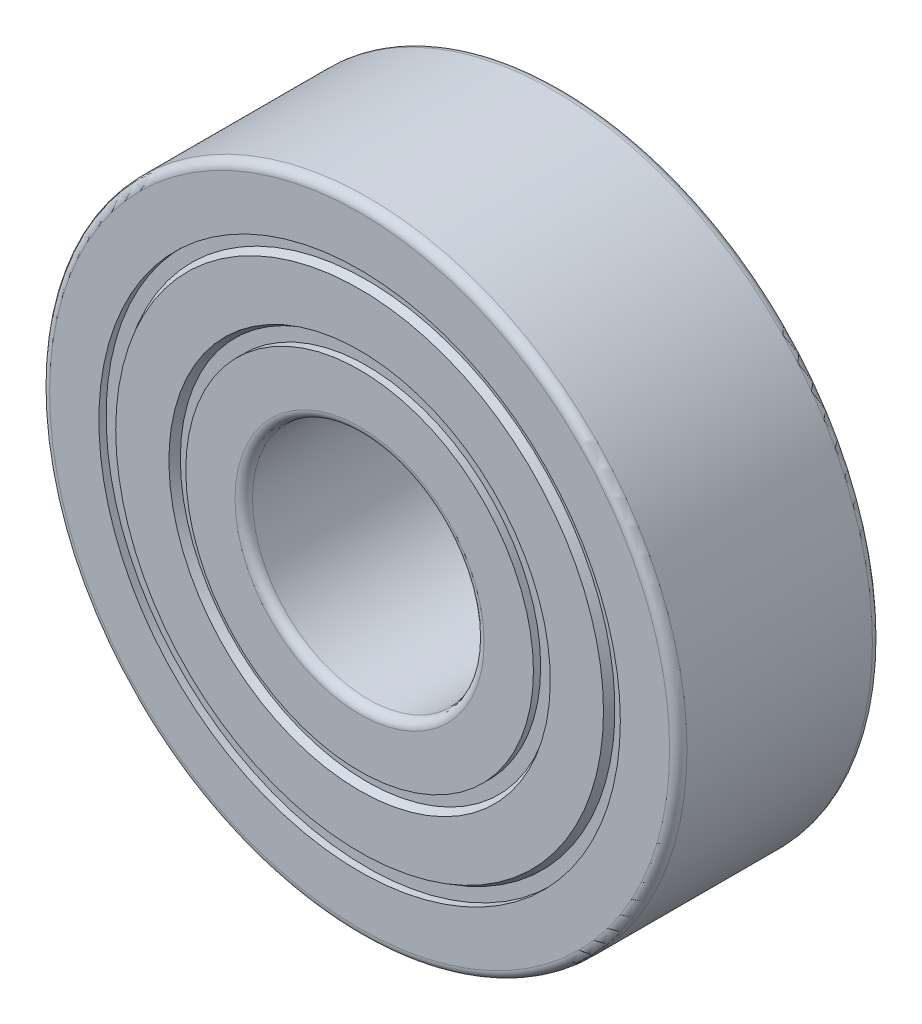
ISO-10303-21;
HEADER;
FILE_DESCRIPTION(('STEP AP214'),'2;1');
FILE_NAME('part.step','',(''),(''),'','','');
FILE_SCHEMA(('AUTOMOTIVE_DESIGN { 1 0 10303 214 1 1 1 1 }'));
ENDSEC;
DATA;
#1=APPLICATION_CONTEXT('core data for automotive mechanical design processes');
#2=APPLICATION_PROTOCOL_DEFINITION('international standard','automotive_design',2000,#1);
#3=PRODUCT_CONTEXT('',#1,'mechanical');
#4=PRODUCT('Part','Part','',(#3));
#5=PRODUCT_RELATED_PRODUCT_CATEGORY('part','',(#4));
#6=PRODUCT_DEFINITION_FORMATION('','',#4);
#7=PRODUCT_DEFINITION_CONTEXT('part definition',#1,'design');
#8=PRODUCT_DEFINITION('design','',#6,#7);
#9=PRODUCT_DEFINITION_SHAPE('','',#8);
#10=(LENGTH_UNIT() NAMED_UNIT(*) SI_UNIT(.MILLI.,.METRE.));
#11=(NAMED_UNIT(*) PLANE_ANGLE_UNIT() SI_UNIT($,.RADIAN.));
#12=(NAMED_UNIT(*) SI_UNIT($,.STERADIAN.) SOLID_ANGLE_UNIT());
#13=UNCERTAINTY_MEASURE_WITH_UNIT(LENGTH_MEASURE(1.E-05),#10,'distance_accuracy_value','');
#14=(GEOMETRIC_REPRESENTATION_CONTEXT(3) GLOBAL_UNCERTAINTY_ASSIGNED_CONTEXT((#13)) GLOBAL_UNIT_ASSIGNED_CONTEXT((#10,
#11,#12)) REPRESENTATION_CONTEXT('',''));
#15=CARTESIAN_POINT('',(0.,0.,0.));
#16=DIRECTION('',(0.,0.,1.));
#17=DIRECTION('',(1.,0.,0.));
#18=AXIS2_PLACEMENT_3D('',#15,#16,#17);
#19=CARTESIAN_POINT('',(0.,0.,2.72220369349935));
#20=DIRECTION('',(0.,0.,1.));
#21=DIRECTION('',(1.,0.,0.));
#22=AXIS2_PLACEMENT_3D('',#19,#20,#21);
#23=CYLINDRICAL_SURFACE('',#22,4.);
#24=CARTESIAN_POINT('',(0.,0.,3.2));
#25=DIRECTION('',(0.,0.,-1.));
#26=DIRECTION('',(-1.,0.,0.));
#27=AXIS2_PLACEMENT_3D('',#24,#25,#26);
#28=CIRCLE('',#27,4.);
#29=CARTESIAN_POINT('',(-4.,0.,3.2));
#30=VERTEX_POINT('',#29);
#31=EDGE_CURVE('E176',#30,#30,#28,.T.);
#32=ORIENTED_EDGE('',*,*,#31,.F.);
#33=EDGE_LOOP('',(#32));
#34=FACE_BOUND('',#33,.T.);
#35=CARTESIAN_POINT('',(0.,0.,-3.2));
#36=DIRECTION('',(0.,0.,-1.));
#37=DIRECTION('',(-1.,0.,0.));
#38=AXIS2_PLACEMENT_3D('',#35,#36,#37);
#39=CIRCLE('',#38,4.);
#40=CARTESIAN_POINT('',(-4.,0.,-3.2));
#41=VERTEX_POINT('',#40);
#42=EDGE_CURVE('E197',#41,#41,#39,.F.);
#43=ORIENTED_EDGE('',*,*,#42,.F.);
#44=EDGE_LOOP('',(#43));
#45=FACE_BOUND('',#44,.T.);
#46=ADVANCED_FACE('F15',(#34,#45),#23,.F.);
#47=CARTESIAN_POINT('',(0.,0.,-3.2));
#48=DIRECTION('',(0.,0.,-1.));
#49=DIRECTION('',(-1.,0.,0.));
#50=AXIS2_PLACEMENT_3D('',#47,#48,#49);
#51=TOROIDAL_SURFACE('',#50,4.3,0.299999999999999);
#52=ORIENTED_EDGE('',*,*,#42,.T.);
#53=EDGE_LOOP('',(#52));
#54=FACE_BOUND('',#53,.T.);
#55=CARTESIAN_POINT('',(0.,0.,-3.5));
#56=DIRECTION('',(0.,0.,-1.));
#57=DIRECTION('',(-1.,0.,0.));
#58=AXIS2_PLACEMENT_3D('',#55,#56,#57);
#59=CIRCLE('',#58,4.3);
#60=CARTESIAN_POINT('',(-4.3,0.,-3.5));
#61=VERTEX_POINT('',#60);
#62=EDGE_CURVE('E165',#61,#61,#59,.F.);
#63=ORIENTED_EDGE('',*,*,#62,.F.);
#64=EDGE_LOOP('',(#63));
#65=FACE_BOUND('',#64,.T.);
#66=ADVANCED_FACE('F181',(#54,#65),#51,.T.);
#67=CARTESIAN_POINT('',(0.,0.,3.2));
#68=DIRECTION('',(0.,0.,-1.));
#69=DIRECTION('',(-1.,0.,0.));
#70=AXIS2_PLACEMENT_3D('',#67,#68,#69);
#71=TOROIDAL_SURFACE('',#70,4.3,0.299999999999999);
#72=CARTESIAN_POINT('',(0.,0.,3.5));
#73=DIRECTION('',(0.,0.,1.));
#74=DIRECTION('',(-1.,0.,0.));
#75=AXIS2_PLACEMENT_3D('',#72,#73,#74);
#76=CIRCLE('',#75,4.3);
#77=CARTESIAN_POINT('',(-4.3,0.,3.5));
#78=VERTEX_POINT('',#77);
#79=EDGE_CURVE('E257',#78,#78,#76,.T.);
#80=ORIENTED_EDGE('',*,*,#79,.T.);
#81=EDGE_LOOP('',(#80));
#82=FACE_BOUND('',#81,.T.);
#83=ORIENTED_EDGE('',*,*,#31,.T.);
#84=EDGE_LOOP('',(#83));
#85=FACE_BOUND('',#84,.T.);
#86=ADVANCED_FACE('F178',(#82,#85),#71,.T.);
#87=CARTESIAN_POINT('',(4.83575292704006,0.,-3.49999999999999));
#88=DIRECTION('',(0.,0.,-1.));
#89=DIRECTION('',(-1.,0.,0.));
#90=AXIS2_PLACEMENT_3D('',#87,#88,#89);
#91=PLANE('',#90);
#92=ORIENTED_EDGE('',*,*,#62,.T.);
#93=EDGE_LOOP('',(#92));
#94=FACE_BOUND('',#93,.T.);
#95=CARTESIAN_POINT('',(0.,0.,-3.49999999999999));
#96=DIRECTION('',(0.,0.,1.));
#97=DIRECTION('',(1.,0.,0.));
#98=AXIS2_PLACEMENT_3D('',#95,#96,#97);
#99=CIRCLE('',#98,6.);
#100=CARTESIAN_POINT('',(6.,0.,-3.49999999999999));
#101=VERTEX_POINT('',#100);
#102=EDGE_CURVE('E18',#101,#101,#99,.T.);
#103=ORIENTED_EDGE('',*,*,#102,.F.);
#104=EDGE_LOOP('',(#103));
#105=FACE_BOUND('',#104,.T.);
#106=ADVANCED_FACE('F146',(#94,#105),#91,.T.);
#107=CARTESIAN_POINT('',(3.67168283958829,0.,3.49999999999999));
#108=DIRECTION('',(0.,0.,-1.));
#109=DIRECTION('',(-1.,0.,0.));
#110=AXIS2_PLACEMENT_3D('',#107,#108,#109);
#111=PLANE('',#110);
#112=ORIENTED_EDGE('',*,*,#79,.F.);
#113=EDGE_LOOP('',(#112));
#114=FACE_BOUND('',#113,.T.);
#115=CARTESIAN_POINT('',(0.,0.,3.49999999999999));
#116=DIRECTION('',(0.,0.,1.));
#117=DIRECTION('',(1.,0.,0.));
#118=AXIS2_PLACEMENT_3D('',#115,#116,#117);
#119=CIRCLE('',#118,6.);
#120=CARTESIAN_POINT('',(6.,0.,3.49999999999999));
#121=VERTEX_POINT('',#120);
#122=EDGE_CURVE('E253',#121,#121,#119,.F.);
#123=ORIENTED_EDGE('',*,*,#122,.F.);
#124=EDGE_LOOP('',(#123));
#125=FACE_BOUND('',#124,.T.);
#126=ADVANCED_FACE('F141',(#114,#125),#111,.F.);
#127=CARTESIAN_POINT('',(0.,0.,2.72220369349935));
#128=DIRECTION('',(0.,0.,1.));
#129=DIRECTION('',(1.,0.,0.));
#130=AXIS2_PLACEMENT_3D('',#127,#128,#129);
#131=CYLINDRICAL_SURFACE('',#130,6.);
#132=ORIENTED_EDGE('',*,*,#102,.T.);
#133=EDGE_LOOP('',(#132));
#134=FACE_BOUND('',#133,.T.);
#135=CARTESIAN_POINT('',(0.,0.,-3.25));
#136=DIRECTION('',(0.,0.,1.));
#137=DIRECTION('',(1.,0.,0.));
#138=AXIS2_PLACEMENT_3D('',#135,#136,#137);
#139=CIRCLE('',#138,6.);
#140=CARTESIAN_POINT('',(6.,0.,-3.25));
#141=VERTEX_POINT('',#140);
#142=EDGE_CURVE('E251',#141,#141,#139,.T.);
#143=ORIENTED_EDGE('',*,*,#142,.F.);
#144=EDGE_LOOP('',(#143));
#145=FACE_BOUND('',#144,.T.);
#146=ADVANCED_FACE('F137',(#134,#145),#131,.T.);
#147=CARTESIAN_POINT('',(0.,0.,2.72220369349935));
#148=DIRECTION('',(0.,0.,1.));
#149=DIRECTION('',(1.,0.,0.));
#150=AXIS2_PLACEMENT_3D('',#147,#148,#149);
#151=CYLINDRICAL_SURFACE('',#150,6.);
#152=ORIENTED_EDGE('',*,*,#122,.T.);
#153=EDGE_LOOP('',(#152));
#154=FACE_BOUND('',#153,.T.);
#155=CARTESIAN_POINT('',(0.,0.,3.25));
#156=DIRECTION('',(0.,0.,1.));
#157=DIRECTION('',(1.,0.,0.));
#158=AXIS2_PLACEMENT_3D('',#155,#156,#157);
#159=CIRCLE('',#158,6.);
#160=CARTESIAN_POINT('',(6.,0.,3.25));
#161=VERTEX_POINT('',#160);
#162=EDGE_CURVE('E248',#161,#161,#159,.T.);
#163=ORIENTED_EDGE('',*,*,#162,.T.);
#164=EDGE_LOOP('',(#163));
#165=FACE_BOUND('',#164,.T.);
#166=ADVANCED_FACE('F133',(#154,#165),#151,.T.);
#167=CARTESIAN_POINT('',(5.95269395127089,0.,-3.25));
#168=DIRECTION('',(0.,0.,-1.));
#169=DIRECTION('',(-1.,0.,0.));
#170=AXIS2_PLACEMENT_3D('',#167,#168,#169);
#171=PLANE('',#170);
#172=ORIENTED_EDGE('',*,*,#142,.T.);
#173=EDGE_LOOP('',(#172));
#174=FACE_BOUND('',#173,.T.);
#175=CARTESIAN_POINT('',(0.,0.,-3.25000000003683));
#176=DIRECTION('',(0.,0.,-1.));
#177=DIRECTION('',(0.,1.,0.));
#178=AXIS2_PLACEMENT_3D('',#175,#176,#177);
#179=CIRCLE('',#178,6.43750000000409);
#180=CARTESIAN_POINT('',(0.,6.43750000000409,-3.25000000003683));
#181=VERTEX_POINT('',#180);
#182=EDGE_CURVE('E245',#181,#181,#179,.T.);
#183=ORIENTED_EDGE('',*,*,#182,.T.);
#184=EDGE_LOOP('',(#183));
#185=FACE_BOUND('',#184,.T.);
#186=ADVANCED_FACE('F129',(#174,#185),#171,.T.);
#187=CARTESIAN_POINT('',(4.7886238638191,0.,3.25));
#188=DIRECTION('',(0.,0.,-1.));
#189=DIRECTION('',(-1.,0.,0.));
#190=AXIS2_PLACEMENT_3D('',#187,#188,#189);
#191=PLANE('',#190);
#192=ORIENTED_EDGE('',*,*,#162,.F.);
#193=EDGE_LOOP('',(#192));
#194=FACE_BOUND('',#193,.T.);
#195=CARTESIAN_POINT('',(0.,0.,3.25000000003683));
#196=DIRECTION('',(0.,0.,1.));
#197=DIRECTION('',(0.,-1.,0.));
#198=AXIS2_PLACEMENT_3D('',#195,#196,#197);
#199=CIRCLE('',#198,6.43750000000409);
#200=CARTESIAN_POINT('',(0.,-6.43750000000409,3.25000000003683));
#201=VERTEX_POINT('',#200);
#202=EDGE_CURVE('E242',#201,#201,#199,.T.);
#203=ORIENTED_EDGE('',*,*,#202,.T.);
#204=EDGE_LOOP('',(#203));
#205=FACE_BOUND('',#204,.T.);
#206=ADVANCED_FACE('F125',(#194,#205),#191,.F.);
#207=CARTESIAN_POINT('',(0.,0.,-3.50000001412809));
#208=DIRECTION('',(0.,0.,-1.));
#209=DIRECTION('',(0.,1.,0.));
#210=AXIS2_PLACEMENT_3D('',#207,#208,#209);
#211=CONICAL_SURFACE('',#210,6.58183757542474,0.523598775561258);
#212=ORIENTED_EDGE('',*,*,#182,.F.);
#213=EDGE_LOOP('',(#212));
#214=FACE_BOUND('',#213,.T.);
#215=CARTESIAN_POINT('',(0.,0.,-3.50000001412809));
#216=DIRECTION('',(0.,0.,-1.));
#217=DIRECTION('',(0.,1.,0.));
#218=AXIS2_PLACEMENT_3D('',#215,#216,#217);
#219=CIRCLE('',#218,6.58183757542474);
#220=CARTESIAN_POINT('',(0.,6.58183757542474,-3.50000001412809));
#221=VERTEX_POINT('',#220);
#222=EDGE_CURVE('E239',#221,#221,#219,.F.);
#223=ORIENTED_EDGE('',*,*,#222,.F.);
#224=EDGE_LOOP('',(#223));
#225=FACE_BOUND('',#224,.T.);
#226=ADVANCED_FACE('F121',(#214,#225),#211,.F.);
#227=CARTESIAN_POINT('',(0.,0.,3.50000001412809));
#228=DIRECTION('',(0.,0.,1.));
#229=DIRECTION('',(0.,-1.,0.));
#230=AXIS2_PLACEMENT_3D('',#227,#228,#229);
#231=CONICAL_SURFACE('',#230,6.58183757542474,0.523598775561258);
#232=ORIENTED_EDGE('',*,*,#202,.F.);
#233=EDGE_LOOP('',(#232));
#234=FACE_BOUND('',#233,.T.);
#235=CARTESIAN_POINT('',(0.,0.,3.50000001412809));
#236=DIRECTION('',(0.,0.,1.));
#237=DIRECTION('',(0.,-1.,0.));
#238=AXIS2_PLACEMENT_3D('',#235,#236,#237);
#239=CIRCLE('',#238,6.58183757542474);
#240=CARTESIAN_POINT('',(0.,-6.58183757542474,3.50000001412809));
#241=VERTEX_POINT('',#240);
#242=EDGE_CURVE('E236',#241,#241,#239,.T.);
#243=ORIENTED_EDGE('',*,*,#242,.T.);
#244=EDGE_LOOP('',(#243));
#245=FACE_BOUND('',#244,.T.);
#246=ADVANCED_FACE('F117',(#234,#245),#231,.F.);
#247=CARTESIAN_POINT('',(7.54609201261815,0.,-3.49999999999999));
#248=DIRECTION('',(0.,0.,-1.));
#249=DIRECTION('',(-1.,0.,0.));
#250=AXIS2_PLACEMENT_3D('',#247,#248,#249);
#251=PLANE('',#250);
#252=ORIENTED_EDGE('',*,*,#222,.T.);
#253=EDGE_LOOP('',(#252));
#254=FACE_BOUND('',#253,.T.);
#255=CARTESIAN_POINT('',(0.,0.,-3.49999999999999));
#256=DIRECTION('',(0.,0.,1.));
#257=DIRECTION('',(1.,0.,0.));
#258=AXIS2_PLACEMENT_3D('',#255,#256,#257);
#259=CIRCLE('',#258,8.4181624);
#260=CARTESIAN_POINT('',(8.4181624,0.,-3.49999999999999));
#261=VERTEX_POINT('',#260);
#262=EDGE_CURVE('E233',#261,#261,#259,.T.);
#263=ORIENTED_EDGE('',*,*,#262,.F.);
#264=EDGE_LOOP('',(#263));
#265=FACE_BOUND('',#264,.T.);
#266=ADVANCED_FACE('F113',(#254,#265),#251,.T.);
#267=CARTESIAN_POINT('',(6.38202192516636,0.,3.49999999999999));
#268=DIRECTION('',(0.,0.,-1.));
#269=DIRECTION('',(-1.,0.,0.));
#270=AXIS2_PLACEMENT_3D('',#267,#268,#269);
#271=PLANE('',#270);
#272=ORIENTED_EDGE('',*,*,#242,.F.);
#273=EDGE_LOOP('',(#272));
#274=FACE_BOUND('',#273,.T.);
#275=CARTESIAN_POINT('',(0.,0.,3.49999999999999));
#276=DIRECTION('',(0.,0.,-1.));
#277=DIRECTION('',(-1.,0.,0.));
#278=AXIS2_PLACEMENT_3D('',#275,#276,#277);
#279=CIRCLE('',#278,8.4181624);
#280=CARTESIAN_POINT('',(-8.4181624,0.,3.49999999999999));
#281=VERTEX_POINT('',#280);
#282=EDGE_CURVE('E230',#281,#281,#279,.T.);
#283=ORIENTED_EDGE('',*,*,#282,.F.);
#284=EDGE_LOOP('',(#283));
#285=FACE_BOUND('',#284,.T.);
#286=ADVANCED_FACE('F109',(#274,#285),#271,.F.);
#287=CARTESIAN_POINT('',(0.,0.,-3.24999998583961));
#288=DIRECTION('',(0.,0.,1.));
#289=DIRECTION('',(1.,0.,0.));
#290=AXIS2_PLACEMENT_3D('',#287,#288,#289);
#291=CONICAL_SURFACE('',#290,8.56249997547347,0.523598775600002);
#292=ORIENTED_EDGE('',*,*,#262,.T.);
#293=EDGE_LOOP('',(#292));
#294=FACE_BOUND('',#293,.T.);
#295=CARTESIAN_POINT('',(0.,0.,-3.24999998583961));
#296=DIRECTION('',(0.,0.,1.));
#297=DIRECTION('',(1.,0.,0.));
#298=AXIS2_PLACEMENT_3D('',#295,#296,#297);
#299=CIRCLE('',#298,8.56249997547347);
#300=CARTESIAN_POINT('',(8.56249997547347,0.,-3.24999998583961));
#301=VERTEX_POINT('',#300);
#302=EDGE_CURVE('E227',#301,#301,#299,.T.);
#303=ORIENTED_EDGE('',*,*,#302,.F.);
#304=EDGE_LOOP('',(#303));
#305=FACE_BOUND('',#304,.T.);
#306=ADVANCED_FACE('F105',(#294,#305),#291,.T.);
#307=CARTESIAN_POINT('',(0.,0.,3.24999998583961));
#308=DIRECTION('',(0.,0.,-1.));
#309=DIRECTION('',(-1.,0.,0.));
#310=AXIS2_PLACEMENT_3D('',#307,#308,#309);
#311=CONICAL_SURFACE('',#310,8.56249997547347,0.523598775600002);
#312=ORIENTED_EDGE('',*,*,#282,.T.);
#313=EDGE_LOOP('',(#312));
#314=FACE_BOUND('',#313,.T.);
#315=CARTESIAN_POINT('',(0.,0.,3.24999998583961));
#316=DIRECTION('',(0.,0.,-1.));
#317=DIRECTION('',(-1.,0.,0.));
#318=AXIS2_PLACEMENT_3D('',#315,#316,#317);
#319=CIRCLE('',#318,8.56249997547347);
#320=CARTESIAN_POINT('',(-8.56249997547347,0.,3.24999998583961));
#321=VERTEX_POINT('',#320);
#322=EDGE_CURVE('E224',#321,#321,#319,.F.);
#323=ORIENTED_EDGE('',*,*,#322,.T.);
#324=EDGE_LOOP('',(#323));
#325=FACE_BOUND('',#324,.T.);
#326=ADVANCED_FACE('F101',(#314,#325),#311,.T.);
#327=CARTESIAN_POINT('',(9.03795024688032,0.,-3.25));
#328=DIRECTION('',(0.,0.,-1.));
#329=DIRECTION('',(-1.,0.,0.));
#330=AXIS2_PLACEMENT_3D('',#327,#328,#329);
#331=PLANE('',#330);
#332=ORIENTED_EDGE('',*,*,#302,.T.);
#333=EDGE_LOOP('',(#332));
#334=FACE_BOUND('',#333,.T.);
#335=CARTESIAN_POINT('',(0.,0.,-3.25));
#336=DIRECTION('',(0.,0.,1.));
#337=DIRECTION('',(1.,0.,0.));
#338=AXIS2_PLACEMENT_3D('',#335,#336,#337);
#339=CIRCLE('',#338,8.99999999999999);
#340=CARTESIAN_POINT('',(8.99999999999999,0.,-3.25));
#341=VERTEX_POINT('',#340);
#342=EDGE_CURVE('E221',#341,#341,#339,.F.);
#343=ORIENTED_EDGE('',*,*,#342,.T.);
#344=EDGE_LOOP('',(#343));
#345=FACE_BOUND('',#344,.T.);
#346=ADVANCED_FACE('F97',(#334,#345),#331,.T.);
#347=CARTESIAN_POINT('',(7.87388015942853,0.,3.25));
#348=DIRECTION('',(0.,0.,-1.));
#349=DIRECTION('',(-1.,0.,0.));
#350=AXIS2_PLACEMENT_3D('',#347,#348,#349);
#351=PLANE('',#350);
#352=ORIENTED_EDGE('',*,*,#322,.F.);
#353=EDGE_LOOP('',(#352));
#354=FACE_BOUND('',#353,.T.);
#355=CARTESIAN_POINT('',(0.,0.,3.25));
#356=DIRECTION('',(0.,0.,1.));
#357=DIRECTION('',(1.,0.,0.));
#358=AXIS2_PLACEMENT_3D('',#355,#356,#357);
#359=CIRCLE('',#358,8.99999999999999);
#360=CARTESIAN_POINT('',(8.99999999999999,0.,3.25));
#361=VERTEX_POINT('',#360);
#362=EDGE_CURVE('E218',#361,#361,#359,.T.);
#363=ORIENTED_EDGE('',*,*,#362,.T.);
#364=EDGE_LOOP('',(#363));
#365=FACE_BOUND('',#364,.T.);
#366=ADVANCED_FACE('F93',(#354,#365),#351,.F.);
#367=CARTESIAN_POINT('',(0.,0.,2.72220369349935));
#368=DIRECTION('',(0.,0.,1.));
#369=DIRECTION('',(1.,0.,0.));
#370=AXIS2_PLACEMENT_3D('',#367,#368,#369);
#371=CYLINDRICAL_SURFACE('',#370,8.99999999999999);
#372=ORIENTED_EDGE('',*,*,#342,.F.);
#373=EDGE_LOOP('',(#372));
#374=FACE_BOUND('',#373,.T.);
#375=CARTESIAN_POINT('',(0.,0.,-3.49999999999999));
#376=DIRECTION('',(0.,0.,1.));
#377=DIRECTION('',(1.,0.,0.));
#378=AXIS2_PLACEMENT_3D('',#375,#376,#377);
#379=CIRCLE('',#378,8.99999999999999);
#380=CARTESIAN_POINT('',(8.99999999999999,0.,-3.49999999999999));
#381=VERTEX_POINT('',#380);
#382=EDGE_CURVE('E215',#381,#381,#379,.T.);
#383=ORIENTED_EDGE('',*,*,#382,.F.);
#384=EDGE_LOOP('',(#383));
#385=FACE_BOUND('',#384,.T.);
#386=ADVANCED_FACE('F89',(#374,#385),#371,.F.);
#387=CARTESIAN_POINT('',(0.,0.,2.72220369349935));
#388=DIRECTION('',(0.,0.,1.));
#389=DIRECTION('',(1.,0.,0.));
#390=AXIS2_PLACEMENT_3D('',#387,#388,#389);
#391=CYLINDRICAL_SURFACE('',#390,8.99999999999999);
#392=ORIENTED_EDGE('',*,*,#362,.F.);
#393=EDGE_LOOP('',(#392));
#394=FACE_BOUND('',#393,.T.);
#395=CARTESIAN_POINT('',(0.,0.,3.49999999999999));
#396=DIRECTION('',(0.,0.,1.));
#397=DIRECTION('',(1.,0.,0.));
#398=AXIS2_PLACEMENT_3D('',#395,#396,#397);
#399=CIRCLE('',#398,8.99999999999999);
#400=CARTESIAN_POINT('',(8.99999999999999,0.,3.49999999999999));
#401=VERTEX_POINT('',#400);
#402=EDGE_CURVE('E207',#401,#401,#399,.T.);
#403=ORIENTED_EDGE('',*,*,#402,.T.);
#404=EDGE_LOOP('',(#403));
#405=FACE_BOUND('',#404,.T.);
#406=ADVANCED_FACE('F84',(#394,#405),#391,.F.);
#407=CARTESIAN_POINT('',(9.97524332614934,0.,-3.49999999999999));
#408=DIRECTION('',(0.,0.,-1.));
#409=DIRECTION('',(-1.,0.,0.));
#410=AXIS2_PLACEMENT_3D('',#407,#408,#409);
#411=PLANE('',#410);
#412=ORIENTED_EDGE('',*,*,#382,.T.);
#413=EDGE_LOOP('',(#412));
#414=FACE_BOUND('',#413,.T.);
#415=CARTESIAN_POINT('',(0.,0.,-3.5));
#416=DIRECTION('',(0.,0.,1.));
#417=DIRECTION('',(-1.,0.,0.));
#418=AXIS2_PLACEMENT_3D('',#415,#416,#417);
#419=CIRCLE('',#418,10.7);
#420=CARTESIAN_POINT('',(-10.7,0.,-3.5));
#421=VERTEX_POINT('',#420);
#422=EDGE_CURVE('E68',#421,#421,#419,.T.);
#423=ORIENTED_EDGE('',*,*,#422,.F.);
#424=EDGE_LOOP('',(#423));
#425=FACE_BOUND('',#424,.T.);
#426=ADVANCED_FACE('F74',(#414,#425),#411,.T.);
#427=CARTESIAN_POINT('',(8.81117323869755,0.,3.49999999999999));
#428=DIRECTION('',(0.,0.,-1.));
#429=DIRECTION('',(-1.,0.,0.));
#430=AXIS2_PLACEMENT_3D('',#427,#428,#429);
#431=PLANE('',#430);
#432=ORIENTED_EDGE('',*,*,#402,.F.);
#433=EDGE_LOOP('',(#432));
#434=FACE_BOUND('',#433,.T.);
#435=CARTESIAN_POINT('',(0.,0.,3.5));
#436=DIRECTION('',(0.,0.,-1.));
#437=DIRECTION('',(-1.,0.,0.));
#438=AXIS2_PLACEMENT_3D('',#435,#436,#437);
#439=CIRCLE('',#438,10.7);
#440=CARTESIAN_POINT('',(-10.7,0.,3.5));
#441=VERTEX_POINT('',#440);
#442=EDGE_CURVE('E27',#441,#441,#439,.T.);
#443=ORIENTED_EDGE('',*,*,#442,.F.);
#444=EDGE_LOOP('',(#443));
#445=FACE_BOUND('',#444,.T.);
#446=ADVANCED_FACE('F83',(#434,#445),#431,.F.);
#447=CARTESIAN_POINT('',(0.,0.,-3.2));
#448=DIRECTION('',(0.,0.,-1.));
#449=DIRECTION('',(-1.,0.,0.));
#450=AXIS2_PLACEMENT_3D('',#447,#448,#449);
#451=TOROIDAL_SURFACE('',#450,10.7,0.299999999999999);
#452=ORIENTED_EDGE('',*,*,#422,.T.);
#453=EDGE_LOOP('',(#452));
#454=FACE_BOUND('',#453,.T.);
#455=CARTESIAN_POINT('',(0.,0.,-3.2));
#456=DIRECTION('',(0.,0.,1.));
#457=DIRECTION('',(1.,0.,0.));
#458=AXIS2_PLACEMENT_3D('',#455,#456,#457);
#459=CIRCLE('',#458,11.);
#460=CARTESIAN_POINT('',(11.,0.,-3.2));
#461=VERTEX_POINT('',#460);
#462=EDGE_CURVE('E22',#461,#461,#459,.T.);
#463=ORIENTED_EDGE('',*,*,#462,.F.);
#464=EDGE_LOOP('',(#463));
#465=FACE_BOUND('',#464,.T.);
#466=ADVANCED_FACE('F47',(#454,#465),#451,.T.);
#467=CARTESIAN_POINT('',(0.,0.,3.2));
#468=DIRECTION('',(0.,0.,-1.));
#469=DIRECTION('',(-1.,0.,0.));
#470=AXIS2_PLACEMENT_3D('',#467,#468,#469);
#471=TOROIDAL_SURFACE('',#470,10.7,0.299999999999999);
#472=CARTESIAN_POINT('',(0.,0.,3.2));
#473=DIRECTION('',(0.,0.,1.));
#474=DIRECTION('',(1.,0.,0.));
#475=AXIS2_PLACEMENT_3D('',#472,#473,#474);
#476=CIRCLE('',#475,11.);
#477=CARTESIAN_POINT('',(11.,0.,3.2));
#478=VERTEX_POINT('',#477);
#479=EDGE_CURVE('E10',#478,#478,#476,.F.);
#480=ORIENTED_EDGE('',*,*,#479,.F.);
#481=EDGE_LOOP('',(#480));
#482=FACE_BOUND('',#481,.T.);
#483=ORIENTED_EDGE('',*,*,#442,.T.);
#484=EDGE_LOOP('',(#483));
#485=FACE_BOUND('',#484,.T.);
#486=ADVANCED_FACE('F41',(#482,#485),#471,.T.);
#487=CARTESIAN_POINT('',(0.,0.,2.72220369349935));
#488=DIRECTION('',(0.,0.,1.));
#489=DIRECTION('',(1.,0.,0.));
#490=AXIS2_PLACEMENT_3D('',#487,#488,#489);
#491=CYLINDRICAL_SURFACE('',#490,11.);
#492=ORIENTED_EDGE('',*,*,#479,.T.);
#493=EDGE_LOOP('',(#492));
#494=FACE_BOUND('',#493,.T.);
#495=ORIENTED_EDGE('',*,*,#462,.T.);
#496=EDGE_LOOP('',(#495));
#497=FACE_BOUND('',#496,.T.);
#498=ADVANCED_FACE('F46',(#494,#497),#491,.T.);
#499=CLOSED_SHELL('',(#46,#66,#86,#106,#126,#146,#166,#186,#206,#226,#246,#266,#286,#306,#326,
#346,#366,#386,#406,#426,#446,#466,#486,#498));
#500=CARTESIAN_POINT('',(0.,0.,0.));
#501=DIRECTION('',(0.,0.,-1.));
#502=DIRECTION('',(-1.,0.,0.));
#503=AXIS2_PLACEMENT_3D('',#500,#501,#502);
#504=TOROIDAL_SURFACE('',#503,7.5,2.1875);
#505=ADVANCED_FACE('F465',(),#504,.F.);
#506=CLOSED_SHELL('',(#505));
#507=ORIENTED_CLOSED_SHELL('',*,#506,.T.);
#508=BREP_WITH_VOIDS('B1',#499,(#507));
#509=ADVANCED_BREP_SHAPE_REPRESENTATION('',(#18,#508),#14);
#510=SHAPE_DEFINITION_REPRESENTATION(#9,#509);
ENDSEC;
END-ISO-10303-21;
